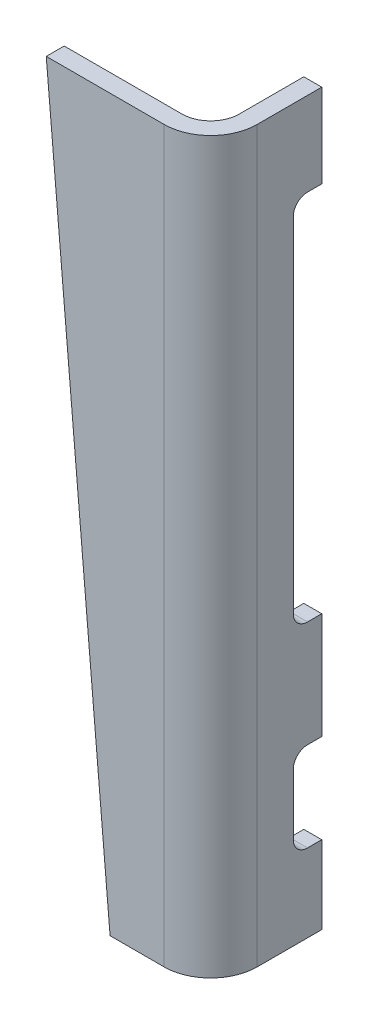
ISO-10303-21;
HEADER;
FILE_DESCRIPTION(('STEP AP214'),'2;1');
FILE_NAME('part.step','',(''),(''),'','','');
FILE_SCHEMA(('AUTOMOTIVE_DESIGN { 1 0 10303 214 1 1 1 1 }'));
ENDSEC;
DATA;
#1=APPLICATION_CONTEXT('core data for automotive mechanical design processes');
#2=APPLICATION_PROTOCOL_DEFINITION('international standard','automotive_design',2000,#1);
#3=PRODUCT_CONTEXT('',#1,'mechanical');
#4=PRODUCT('Part','Part','',(#3));
#5=PRODUCT_RELATED_PRODUCT_CATEGORY('part','',(#4));
#6=PRODUCT_DEFINITION_FORMATION('','',#4);
#7=PRODUCT_DEFINITION_CONTEXT('part definition',#1,'design');
#8=PRODUCT_DEFINITION('design','',#6,#7);
#9=PRODUCT_DEFINITION_SHAPE('','',#8);
#10=(LENGTH_UNIT() NAMED_UNIT(*) SI_UNIT(.MILLI.,.METRE.));
#11=(NAMED_UNIT(*) PLANE_ANGLE_UNIT() SI_UNIT($,.RADIAN.));
#12=(NAMED_UNIT(*) SI_UNIT($,.STERADIAN.) SOLID_ANGLE_UNIT());
#13=UNCERTAINTY_MEASURE_WITH_UNIT(LENGTH_MEASURE(1.E-05),#10,'distance_accuracy_value','');
#14=(GEOMETRIC_REPRESENTATION_CONTEXT(3) GLOBAL_UNCERTAINTY_ASSIGNED_CONTEXT((#13)) GLOBAL_UNIT_ASSIGNED_CONTEXT((#10,
#11,#12)) REPRESENTATION_CONTEXT('',''));
#15=CARTESIAN_POINT('',(0.,0.,0.));
#16=DIRECTION('',(0.,0.,1.));
#17=DIRECTION('',(1.,0.,0.));
#18=AXIS2_PLACEMENT_3D('',#15,#16,#17);
#19=CARTESIAN_POINT('',(-25.79021716039,-28.67914,-116.32184));
#20=DIRECTION('',(0.,-1.,0.));
#21=DIRECTION('',(0.,0.,-1.));
#22=AXIS2_PLACEMENT_3D('',#19,#20,#21);
#23=PLANE('',#22);
#24=DIRECTION('',(0.,0.,-1.));
#25=VECTOR('',#24,1.);
#26=CARTESIAN_POINT('',(-10.12616875329,-28.67914,-2.75336));
#27=LINE('',#26,#25);
#28=CARTESIAN_POINT('',(-10.12616875329,-28.67914,-116.32184));
#29=VERTEX_POINT('',#28);
#30=CARTESIAN_POINT('',(-10.12616875329,-28.67914,-113.94059));
#31=VERTEX_POINT('',#30);
#32=EDGE_CURVE('E247',#29,#31,#27,.F.);
#33=ORIENTED_EDGE('',*,*,#32,.T.);
#34=DIRECTION('',(1.,0.,0.));
#35=VECTOR('',#34,1.);
#36=CARTESIAN_POINT('',(-25.79021716039,-28.67914,-113.94059));
#37=LINE('',#36,#35);
#38=CARTESIAN_POINT('',(-7.126168753292,-28.67914,-113.94059));
#39=VERTEX_POINT('',#38);
#40=EDGE_CURVE('E110',#31,#39,#37,.T.);
#41=ORIENTED_EDGE('',*,*,#40,.T.);
#42=DIRECTION('',(0.,0.,-1.));
#43=VECTOR('',#42,1.);
#44=CARTESIAN_POINT('',(-7.126168753292,-28.67914,-2.75336));
#45=LINE('',#44,#43);
#46=CARTESIAN_POINT('',(-7.126168753292,-28.67914,-116.32184));
#47=VERTEX_POINT('',#46);
#48=EDGE_CURVE('E186',#47,#39,#45,.F.);
#49=ORIENTED_EDGE('',*,*,#48,.F.);
#50=DIRECTION('',(-1.,0.,0.));
#51=VECTOR('',#50,1.);
#52=CARTESIAN_POINT('',(-5.363668753293,-28.67914,-116.32184));
#53=LINE('',#52,#51);
#54=EDGE_CURVE('E120',#29,#47,#53,.F.);
#55=ORIENTED_EDGE('',*,*,#54,.F.);
#56=EDGE_LOOP('',(#33,#41,#49,#55));
#57=FACE_BOUND('',#56,.T.);
#58=ADVANCED_FACE('F17',(#57),#23,.F.);
#59=CARTESIAN_POINT('',(-25.79021716039,-26.29789,-113.94059));
#60=DIRECTION('',(1.,0.,0.));
#61=DIRECTION('',(0.,0.,-1.));
#62=AXIS2_PLACEMENT_3D('',#59,#60,#61);
#63=CYLINDRICAL_SURFACE('',#62,2.38125);
#64=CARTESIAN_POINT('',(-10.12616875329,-26.29789,-113.94059));
#65=DIRECTION('',(1.,0.,0.));
#66=DIRECTION('',(0.,0.,-1.));
#67=AXIS2_PLACEMENT_3D('',#64,#65,#66);
#68=CIRCLE('',#67,2.38125);
#69=CARTESIAN_POINT('',(-10.12616875329,-26.29789,-111.55934));
#70=VERTEX_POINT('',#69);
#71=EDGE_CURVE('E20',#31,#70,#68,.F.);
#72=ORIENTED_EDGE('',*,*,#71,.T.);
#73=DIRECTION('',(1.,0.,0.));
#74=VECTOR('',#73,1.);
#75=CARTESIAN_POINT('',(-25.79021716039,-26.29789,-111.55934));
#76=LINE('',#75,#74);
#77=CARTESIAN_POINT('',(-7.126168753292,-26.29789,-111.55934));
#78=VERTEX_POINT('',#77);
#79=EDGE_CURVE('E296',#70,#78,#76,.T.);
#80=ORIENTED_EDGE('',*,*,#79,.T.);
#81=CARTESIAN_POINT('',(-7.126168753292,-26.29789,-113.94059));
#82=DIRECTION('',(1.,0.,0.));
#83=DIRECTION('',(0.,0.,-1.));
#84=AXIS2_PLACEMENT_3D('',#81,#82,#83);
#85=CIRCLE('',#84,2.38125);
#86=EDGE_CURVE('E191',#39,#78,#85,.F.);
#87=ORIENTED_EDGE('',*,*,#86,.F.);
#88=ORIENTED_EDGE('',*,*,#40,.F.);
#89=EDGE_LOOP('',(#72,#80,#87,#88));
#90=FACE_BOUND('',#89,.T.);
#91=ADVANCED_FACE('F346',(#90),#63,.F.);
#92=CARTESIAN_POINT('',(-25.79021716039,-16.13789,-111.55934));
#93=DIRECTION('',(0.,0.,1.));
#94=DIRECTION('',(1.,0.,0.));
#95=AXIS2_PLACEMENT_3D('',#92,#93,#94);
#96=PLANE('',#95);
#97=DIRECTION('',(0.,1.,0.));
#98=VECTOR('',#97,1.);
#99=CARTESIAN_POINT('',(-10.12616875329,0.,-111.55934));
#100=LINE('',#99,#98);
#101=CARTESIAN_POINT('',(-10.12616875329,-16.13789,-111.55934));
#102=VERTEX_POINT('',#101);
#103=EDGE_CURVE('E244',#70,#102,#100,.T.);
#104=ORIENTED_EDGE('',*,*,#103,.T.);
#105=DIRECTION('',(1.,0.,0.));
#106=VECTOR('',#105,1.);
#107=CARTESIAN_POINT('',(-25.79021716039,-16.13789,-111.55934));
#108=LINE('',#107,#106);
#109=CARTESIAN_POINT('',(-7.126168753292,-16.13789,-111.55934));
#110=VERTEX_POINT('',#109);
#111=EDGE_CURVE('E293',#102,#110,#108,.T.);
#112=ORIENTED_EDGE('',*,*,#111,.T.);
#113=DIRECTION('',(0.,1.,0.));
#114=VECTOR('',#113,1.);
#115=CARTESIAN_POINT('',(-7.126168753292,0.,-111.55934));
#116=LINE('',#115,#114);
#117=EDGE_CURVE('E193',#78,#110,#116,.T.);
#118=ORIENTED_EDGE('',*,*,#117,.F.);
#119=ORIENTED_EDGE('',*,*,#79,.F.);
#120=EDGE_LOOP('',(#104,#112,#118,#119));
#121=FACE_BOUND('',#120,.T.);
#122=ADVANCED_FACE('F344',(#121),#96,.F.);
#123=CARTESIAN_POINT('',(-25.79021716039,-16.13789,-113.94059));
#124=DIRECTION('',(1.,0.,0.));
#125=DIRECTION('',(0.,0.,-1.));
#126=AXIS2_PLACEMENT_3D('',#123,#124,#125);
#127=CYLINDRICAL_SURFACE('',#126,2.38125);
#128=CARTESIAN_POINT('',(-10.12616875329,-16.13789,-113.94059));
#129=DIRECTION('',(1.,0.,0.));
#130=DIRECTION('',(0.,0.,-1.));
#131=AXIS2_PLACEMENT_3D('',#128,#129,#130);
#132=CIRCLE('',#131,2.38125);
#133=CARTESIAN_POINT('',(-10.12616875329,-13.75664,-113.94059));
#134=VERTEX_POINT('',#133);
#135=EDGE_CURVE('E241',#102,#134,#132,.F.);
#136=ORIENTED_EDGE('',*,*,#135,.T.);
#137=DIRECTION('',(1.,0.,0.));
#138=VECTOR('',#137,1.);
#139=CARTESIAN_POINT('',(-25.79021716039,-13.75664,-113.94059));
#140=LINE('',#139,#138);
#141=CARTESIAN_POINT('',(-7.126168753292,-13.75664,-113.94059));
#142=VERTEX_POINT('',#141);
#143=EDGE_CURVE('E288',#134,#142,#140,.T.);
#144=ORIENTED_EDGE('',*,*,#143,.T.);
#145=CARTESIAN_POINT('',(-7.126168753292,-16.13789,-113.94059));
#146=DIRECTION('',(1.,0.,0.));
#147=DIRECTION('',(0.,0.,-1.));
#148=AXIS2_PLACEMENT_3D('',#145,#146,#147);
#149=CIRCLE('',#148,2.38125);
#150=EDGE_CURVE('E326',#110,#142,#149,.F.);
#151=ORIENTED_EDGE('',*,*,#150,.F.);
#152=ORIENTED_EDGE('',*,*,#111,.F.);
#153=EDGE_LOOP('',(#136,#144,#151,#152));
#154=FACE_BOUND('',#153,.T.);
#155=ADVANCED_FACE('F334',(#154),#127,.F.);
#156=CARTESIAN_POINT('',(-25.79021716039,-13.75664,-116.32184));
#157=DIRECTION('',(0.,1.,0.));
#158=DIRECTION('',(0.,0.,1.));
#159=AXIS2_PLACEMENT_3D('',#156,#157,#158);
#160=PLANE('',#159);
#161=DIRECTION('',(0.,0.,-1.));
#162=VECTOR('',#161,1.);
#163=CARTESIAN_POINT('',(-10.12616875329,-13.75664,-2.75336));
#164=LINE('',#163,#162);
#165=CARTESIAN_POINT('',(-10.12616875329,-13.75664,-116.32184));
#166=VERTEX_POINT('',#165);
#167=EDGE_CURVE('E238',#134,#166,#164,.T.);
#168=ORIENTED_EDGE('',*,*,#167,.T.);
#169=DIRECTION('',(-1.,0.,0.));
#170=VECTOR('',#169,1.);
#171=CARTESIAN_POINT('',(-5.363668753293,-13.75664,-116.32184));
#172=LINE('',#171,#170);
#173=CARTESIAN_POINT('',(-7.126168753292,-13.75664,-116.32184));
#174=VERTEX_POINT('',#173);
#175=EDGE_CURVE('E278',#174,#166,#172,.T.);
#176=ORIENTED_EDGE('',*,*,#175,.F.);
#177=DIRECTION('',(0.,0.,-1.));
#178=VECTOR('',#177,1.);
#179=CARTESIAN_POINT('',(-7.126168753292,-13.75664,-2.75336));
#180=LINE('',#179,#178);
#181=EDGE_CURVE('E284',#142,#174,#180,.T.);
#182=ORIENTED_EDGE('',*,*,#181,.F.);
#183=ORIENTED_EDGE('',*,*,#143,.F.);
#184=EDGE_LOOP('',(#168,#176,#182,#183));
#185=FACE_BOUND('',#184,.T.);
#186=ADVANCED_FACE('F380',(#185),#160,.F.);
#187=CARTESIAN_POINT('',(-5.363668753293,80.22336,-116.32184));
#188=DIRECTION('',(0.,0.,-1.));
#189=DIRECTION('',(-1.,0.,0.));
#190=AXIS2_PLACEMENT_3D('',#187,#188,#189);
#191=PLANE('',#190);
#192=DIRECTION('',(0.,1.,0.));
#193=VECTOR('',#192,1.);
#194=CARTESIAN_POINT('',(-7.126168753292,0.,-116.32184));
#195=LINE('',#194,#193);
#196=CARTESIAN_POINT('',(-7.126168753292,4.02336,-116.32184));
#197=VERTEX_POINT('',#196);
#198=EDGE_CURVE('E281',#174,#197,#195,.T.);
#199=ORIENTED_EDGE('',*,*,#198,.F.);
#200=ORIENTED_EDGE('',*,*,#175,.T.);
#201=DIRECTION('',(0.,1.,0.));
#202=VECTOR('',#201,1.);
#203=CARTESIAN_POINT('',(-10.12616875329,0.,-116.32184));
#204=LINE('',#203,#202);
#205=CARTESIAN_POINT('',(-10.12616875329,4.02336,-116.32184));
#206=VERTEX_POINT('',#205);
#207=EDGE_CURVE('E235',#166,#206,#204,.T.);
#208=ORIENTED_EDGE('',*,*,#207,.T.);
#209=DIRECTION('',(1.,0.,0.));
#210=VECTOR('',#209,1.);
#211=CARTESIAN_POINT('',(72.09491389266,4.02336,-116.32184));
#212=LINE('',#211,#210);
#213=EDGE_CURVE('E275',#206,#197,#212,.T.);
#214=ORIENTED_EDGE('',*,*,#213,.T.);
#215=EDGE_LOOP('',(#199,#200,#208,#214));
#216=FACE_BOUND('',#215,.T.);
#217=ADVANCED_FACE('F382',(#216),#191,.T.);
#218=CARTESIAN_POINT('',(72.09491389266,4.02336,-113.94059));
#219=DIRECTION('',(0.,-1.,0.));
#220=DIRECTION('',(0.,0.,-1.));
#221=AXIS2_PLACEMENT_3D('',#218,#219,#220);
#222=PLANE('',#221);
#223=DIRECTION('',(0.,0.,-1.));
#224=VECTOR('',#223,1.);
#225=CARTESIAN_POINT('',(-10.12616875329,4.02336,-2.75336));
#226=LINE('',#225,#224);
#227=CARTESIAN_POINT('',(-10.12616875329,4.02336,-113.94059));
#228=VERTEX_POINT('',#227);
#229=EDGE_CURVE('E232',#206,#228,#226,.F.);
#230=ORIENTED_EDGE('',*,*,#229,.T.);
#231=DIRECTION('',(-1.,0.,0.));
#232=VECTOR('',#231,1.);
#233=CARTESIAN_POINT('',(72.09491389266,4.02336,-113.94059));
#234=LINE('',#233,#232);
#235=CARTESIAN_POINT('',(-7.126168753292,4.02336,-113.94059));
#236=VERTEX_POINT('',#235);
#237=EDGE_CURVE('E272',#228,#236,#234,.F.);
#238=ORIENTED_EDGE('',*,*,#237,.T.);
#239=DIRECTION('',(0.,0.,-1.));
#240=VECTOR('',#239,1.);
#241=CARTESIAN_POINT('',(-7.126168753292,4.02336,-2.75336));
#242=LINE('',#241,#240);
#243=EDGE_CURVE('E283',#197,#236,#242,.F.);
#244=ORIENTED_EDGE('',*,*,#243,.F.);
#245=ORIENTED_EDGE('',*,*,#213,.F.);
#246=EDGE_LOOP('',(#230,#238,#244,#245));
#247=FACE_BOUND('',#246,.T.);
#248=ADVANCED_FACE('F386',(#247),#222,.F.);
#249=CARTESIAN_POINT('',(72.09491389266,6.40461,-113.94059));
#250=DIRECTION('',(-1.,0.,0.));
#251=DIRECTION('',(0.,0.,1.));
#252=AXIS2_PLACEMENT_3D('',#249,#250,#251);
#253=CYLINDRICAL_SURFACE('',#252,2.38125);
#254=CARTESIAN_POINT('',(-10.12616875329,6.40461,-113.94059));
#255=DIRECTION('',(-1.,0.,0.));
#256=DIRECTION('',(0.,0.,1.));
#257=AXIS2_PLACEMENT_3D('',#254,#255,#256);
#258=CIRCLE('',#257,2.38125);
#259=CARTESIAN_POINT('',(-10.12616875329,6.40461,-111.55934));
#260=VERTEX_POINT('',#259);
#261=EDGE_CURVE('E231',#228,#260,#258,.T.);
#262=ORIENTED_EDGE('',*,*,#261,.T.);
#263=DIRECTION('',(1.,0.,0.));
#264=VECTOR('',#263,1.);
#265=CARTESIAN_POINT('',(72.09491389266,6.40461,-111.55934));
#266=LINE('',#265,#264);
#267=CARTESIAN_POINT('',(-7.126168753292,6.40461,-111.55934));
#268=VERTEX_POINT('',#267);
#269=EDGE_CURVE('E269',#260,#268,#266,.T.);
#270=ORIENTED_EDGE('',*,*,#269,.T.);
#271=CARTESIAN_POINT('',(-7.126168753292,6.40461,-113.94059));
#272=DIRECTION('',(-1.,0.,0.));
#273=DIRECTION('',(0.,0.,1.));
#274=AXIS2_PLACEMENT_3D('',#271,#272,#273);
#275=CIRCLE('',#274,2.38125);
#276=EDGE_CURVE('E324',#236,#268,#275,.T.);
#277=ORIENTED_EDGE('',*,*,#276,.F.);
#278=ORIENTED_EDGE('',*,*,#237,.F.);
#279=EDGE_LOOP('',(#262,#270,#277,#278));
#280=FACE_BOUND('',#279,.T.);
#281=ADVANCED_FACE('F390',(#280),#253,.F.);
#282=CARTESIAN_POINT('',(72.09491389266,65.14211,-111.55934));
#283=DIRECTION('',(0.,0.,1.));
#284=DIRECTION('',(1.,0.,0.));
#285=AXIS2_PLACEMENT_3D('',#282,#283,#284);
#286=PLANE('',#285);
#287=DIRECTION('',(0.,1.,0.));
#288=VECTOR('',#287,1.);
#289=CARTESIAN_POINT('',(-7.126168753292,0.,-111.55934));
#290=LINE('',#289,#288);
#291=CARTESIAN_POINT('',(-7.1261687532925,63.84236,-111.55934));
#292=VERTEX_POINT('',#291);
#293=EDGE_CURVE('E323',#268,#292,#290,.T.);
#294=ORIENTED_EDGE('',*,*,#293,.F.);
#295=ORIENTED_EDGE('',*,*,#269,.F.);
#296=DIRECTION('',(0.,1.,0.));
#297=VECTOR('',#296,1.);
#298=CARTESIAN_POINT('',(-10.12616875329,0.,-111.55934));
#299=LINE('',#298,#297);
#300=CARTESIAN_POINT('',(-10.12616875329,63.84236,-111.55934));
#301=VERTEX_POINT('',#300);
#302=EDGE_CURVE('E228',#260,#301,#299,.T.);
#303=ORIENTED_EDGE('',*,*,#302,.T.);
#304=DIRECTION('',(-1.,0.,0.));
#305=VECTOR('',#304,1.);
#306=CARTESIAN_POINT('',(40.07981211837,63.84236,-111.55934));
#307=LINE('',#306,#305);
#308=EDGE_CURVE('E266',#301,#292,#307,.F.);
#309=ORIENTED_EDGE('',*,*,#308,.T.);
#310=EDGE_LOOP('',(#294,#295,#303,#309));
#311=FACE_BOUND('',#310,.T.);
#312=ADVANCED_FACE('F394',(#311),#286,.F.);
#313=CARTESIAN_POINT('',(40.07981211837,63.84236,-113.94034));
#314=DIRECTION('',(-1.,0.,0.));
#315=DIRECTION('',(0.,0.,1.));
#316=AXIS2_PLACEMENT_3D('',#313,#314,#315);
#317=CYLINDRICAL_SURFACE('',#316,2.381);
#318=CARTESIAN_POINT('',(-10.12616875329,63.84236,-113.94034));
#319=DIRECTION('',(-1.,0.,0.));
#320=DIRECTION('',(0.,0.,1.));
#321=AXIS2_PLACEMENT_3D('',#318,#319,#320);
#322=CIRCLE('',#321,2.381);
#323=CARTESIAN_POINT('',(-10.12616875329,66.22336,-113.94034));
#324=VERTEX_POINT('',#323);
#325=EDGE_CURVE('E225',#301,#324,#322,.T.);
#326=ORIENTED_EDGE('',*,*,#325,.T.);
#327=DIRECTION('',(1.,0.,0.));
#328=VECTOR('',#327,1.);
#329=CARTESIAN_POINT('',(40.07981211837,66.22336,-113.94034));
#330=LINE('',#329,#328);
#331=CARTESIAN_POINT('',(-7.1261687532925,66.22336,-113.94034));
#332=VERTEX_POINT('',#331);
#333=EDGE_CURVE('E182',#324,#332,#330,.T.);
#334=ORIENTED_EDGE('',*,*,#333,.T.);
#335=CARTESIAN_POINT('',(-7.126168753293,63.84236,-113.94034));
#336=DIRECTION('',(-1.,0.,0.));
#337=DIRECTION('',(0.,0.,1.));
#338=AXIS2_PLACEMENT_3D('',#335,#336,#337);
#339=CIRCLE('',#338,2.381);
#340=EDGE_CURVE('E321',#292,#332,#339,.T.);
#341=ORIENTED_EDGE('',*,*,#340,.F.);
#342=ORIENTED_EDGE('',*,*,#308,.F.);
#343=EDGE_LOOP('',(#326,#334,#341,#342));
#344=FACE_BOUND('',#343,.T.);
#345=ADVANCED_FACE('F397',(#344),#317,.F.);
#346=CARTESIAN_POINT('',(40.07981211837,66.22336,-116.32184));
#347=DIRECTION('',(0.,1.,0.));
#348=DIRECTION('',(0.,0.,1.));
#349=AXIS2_PLACEMENT_3D('',#346,#347,#348);
#350=PLANE('',#349);
#351=DIRECTION('',(0.,0.,-1.));
#352=VECTOR('',#351,1.);
#353=CARTESIAN_POINT('',(-10.12616875329,66.22336,-2.75336));
#354=LINE('',#353,#352);
#355=CARTESIAN_POINT('',(-10.12616875329,66.22336,-116.32184));
#356=VERTEX_POINT('',#355);
#357=EDGE_CURVE('E213',#324,#356,#354,.T.);
#358=ORIENTED_EDGE('',*,*,#357,.T.);
#359=DIRECTION('',(-1.,0.,0.));
#360=VECTOR('',#359,1.);
#361=CARTESIAN_POINT('',(-5.363668753293,66.22336,-116.32184));
#362=LINE('',#361,#360);
#363=CARTESIAN_POINT('',(-7.12616875329233,66.22336,-116.32184));
#364=VERTEX_POINT('',#363);
#365=EDGE_CURVE('E171',#364,#356,#362,.T.);
#366=ORIENTED_EDGE('',*,*,#365,.F.);
#367=DIRECTION('',(0.,0.,-1.));
#368=VECTOR('',#367,1.);
#369=CARTESIAN_POINT('',(-7.126168753292,66.22336,-2.75336));
#370=LINE('',#369,#368);
#371=EDGE_CURVE('E218',#332,#364,#370,.T.);
#372=ORIENTED_EDGE('',*,*,#371,.F.);
#373=ORIENTED_EDGE('',*,*,#333,.F.);
#374=EDGE_LOOP('',(#358,#366,#372,#373));
#375=FACE_BOUND('',#374,.T.);
#376=ADVANCED_FACE('F436',(#375),#350,.F.);
#377=CARTESIAN_POINT('',(-5.363668753293,80.22336,-116.32184));
#378=DIRECTION('',(0.,0.,-1.));
#379=DIRECTION('',(-1.,0.,0.));
#380=AXIS2_PLACEMENT_3D('',#377,#378,#379);
#381=PLANE('',#380);
#382=DIRECTION('',(0.,1.,0.));
#383=VECTOR('',#382,1.);
#384=CARTESIAN_POINT('',(-10.12616875329,0.,-116.32184));
#385=LINE('',#384,#383);
#386=CARTESIAN_POINT('',(-10.12616875329,-41.69664,-116.32184));
#387=VERTEX_POINT('',#386);
#388=EDGE_CURVE('E181',#387,#29,#385,.T.);
#389=ORIENTED_EDGE('',*,*,#388,.T.);
#390=ORIENTED_EDGE('',*,*,#54,.T.);
#391=DIRECTION('',(0.,1.,0.));
#392=VECTOR('',#391,1.);
#393=CARTESIAN_POINT('',(-7.126168753292,0.,-116.32184));
#394=LINE('',#393,#392);
#395=CARTESIAN_POINT('',(-7.126168753292,-41.69664,-116.32184));
#396=VERTEX_POINT('',#395);
#397=EDGE_CURVE('E179',#396,#47,#394,.T.);
#398=ORIENTED_EDGE('',*,*,#397,.F.);
#399=DIRECTION('',(1.,0.,0.));
#400=VECTOR('',#399,1.);
#401=CARTESIAN_POINT('',(-5.363668753292,-41.69664,-116.32184));
#402=LINE('',#401,#400);
#403=EDGE_CURVE('E217',#387,#396,#402,.T.);
#404=ORIENTED_EDGE('',*,*,#403,.F.);
#405=EDGE_LOOP('',(#389,#390,#398,#404));
#406=FACE_BOUND('',#405,.T.);
#407=ADVANCED_FACE('F177',(#406),#381,.T.);
#408=CARTESIAN_POINT('',(-5.363668753293,80.22336,-116.32184));
#409=DIRECTION('',(0.,0.,-1.));
#410=DIRECTION('',(-1.,0.,0.));
#411=AXIS2_PLACEMENT_3D('',#408,#409,#410);
#412=PLANE('',#411);
#413=DIRECTION('',(0.,1.,0.));
#414=VECTOR('',#413,1.);
#415=CARTESIAN_POINT('',(-7.126168753292,0.,-116.32184));
#416=LINE('',#415,#414);
#417=CARTESIAN_POINT('',(-7.12616875329267,80.2233600000003,-116.32184));
#418=VERTEX_POINT('',#417);
#419=EDGE_CURVE('E201',#364,#418,#416,.T.);
#420=ORIENTED_EDGE('',*,*,#419,.F.);
#421=ORIENTED_EDGE('',*,*,#365,.T.);
#422=DIRECTION('',(0.,1.,0.));
#423=VECTOR('',#422,1.);
#424=CARTESIAN_POINT('',(-10.12616875329,0.,-116.32184));
#425=LINE('',#424,#423);
#426=CARTESIAN_POINT('',(-10.12616875329,80.2233600000003,-116.32184));
#427=VERTEX_POINT('',#426);
#428=EDGE_CURVE('E251',#356,#427,#425,.T.);
#429=ORIENTED_EDGE('',*,*,#428,.T.);
#430=DIRECTION('',(1.,0.,0.));
#431=VECTOR('',#430,1.);
#432=CARTESIAN_POINT('',(-5.363668753293,80.2233600000003,-116.32184));
#433=LINE('',#432,#431);
#434=EDGE_CURVE('E206',#418,#427,#433,.F.);
#435=ORIENTED_EDGE('',*,*,#434,.F.);
#436=EDGE_LOOP('',(#420,#421,#429,#435));
#437=FACE_BOUND('',#436,.T.);
#438=ADVANCED_FACE('F402',(#437),#412,.T.);
#439=CARTESIAN_POINT('',(-10.12616875329,0.,-2.75336));
#440=DIRECTION('',(1.,0.,0.));
#441=DIRECTION('',(0.,0.,-1.));
#442=AXIS2_PLACEMENT_3D('',#439,#440,#441);
#443=PLANE('',#442);
#444=ORIENTED_EDGE('',*,*,#325,.F.);
#445=ORIENTED_EDGE('',*,*,#302,.F.);
#446=ORIENTED_EDGE('',*,*,#261,.F.);
#447=ORIENTED_EDGE('',*,*,#229,.F.);
#448=ORIENTED_EDGE('',*,*,#207,.F.);
#449=ORIENTED_EDGE('',*,*,#167,.F.);
#450=ORIENTED_EDGE('',*,*,#135,.F.);
#451=ORIENTED_EDGE('',*,*,#103,.F.);
#452=ORIENTED_EDGE('',*,*,#71,.F.);
#453=ORIENTED_EDGE('',*,*,#32,.F.);
#454=ORIENTED_EDGE('',*,*,#388,.F.);
#455=DIRECTION('',(0.,0.,-1.));
#456=VECTOR('',#455,1.);
#457=CARTESIAN_POINT('',(-10.12616875329,-41.69664,-116.32184));
#458=LINE('',#457,#456);
#459=CARTESIAN_POINT('',(-10.12616875329,-41.69664,-105.53192));
#460=VERTEX_POINT('',#459);
#461=EDGE_CURVE('E316',#460,#387,#458,.T.);
#462=ORIENTED_EDGE('',*,*,#461,.F.);
#463=DIRECTION('',(0.,1.,0.));
#464=VECTOR('',#463,1.);
#465=CARTESIAN_POINT('',(-10.12616875329,80.22336,-105.53192));
#466=LINE('',#465,#464);
#467=CARTESIAN_POINT('',(-10.12616875329,80.22336,-105.53192));
#468=VERTEX_POINT('',#467);
#469=EDGE_CURVE('E209',#460,#468,#466,.T.);
#470=ORIENTED_EDGE('',*,*,#469,.T.);
#471=DIRECTION('',(0.,0.,1.));
#472=VECTOR('',#471,1.);
#473=CARTESIAN_POINT('',(-10.12616875329,80.22336,-100.75672));
#474=LINE('',#473,#472);
#475=EDGE_CURVE('E208',#427,#468,#474,.T.);
#476=ORIENTED_EDGE('',*,*,#475,.F.);
#477=ORIENTED_EDGE('',*,*,#428,.F.);
#478=ORIENTED_EDGE('',*,*,#357,.F.);
#479=EDGE_LOOP('',(#444,#445,#446,#447,#448,#449,#450,#451,#452,#453,#454,#462,#470,#476,#477,#478));
#480=FACE_BOUND('',#479,.T.);
#481=ADVANCED_FACE('F341',(#480),#443,.F.);
#482=CARTESIAN_POINT('',(22.61016249341,1.97644617377E-13,-97.75672));
#483=DIRECTION('',(0.,0.,1.));
#484=DIRECTION('',(1.,0.,0.));
#485=AXIS2_PLACEMENT_3D('',#482,#483,#484);
#486=PLANE('',#485);
#487=DIRECTION('',(0.,1.,0.));
#488=VECTOR('',#487,1.);
#489=CARTESIAN_POINT('',(-14.90136875329,80.22336,-97.75672));
#490=LINE('',#489,#488);
#491=CARTESIAN_POINT('',(-14.90136875329,80.22336,-97.75672));
#492=VERTEX_POINT('',#491);
#493=CARTESIAN_POINT('',(-14.90136875329,-41.69664,-97.75672));
#494=VERTEX_POINT('',#493);
#495=EDGE_CURVE('E203',#492,#494,#490,.F.);
#496=ORIENTED_EDGE('',*,*,#495,.F.);
#497=DIRECTION('',(1.,0.,0.));
#498=VECTOR('',#497,1.);
#499=CARTESIAN_POINT('',(-5.363668753293,80.22336,-97.75672));
#500=LINE('',#499,#498);
#501=CARTESIAN_POINT('',(-34.5980037380773,80.2233600000002,-97.75672));
#502=VERTEX_POINT('',#501);
#503=EDGE_CURVE('E311',#502,#492,#500,.T.);
#504=ORIENTED_EDGE('',*,*,#503,.F.);
#505=DIRECTION('',(-0.0871557427476639,0.996194698091745,0.));
#506=VECTOR('',#505,1.);
#507=CARTESIAN_POINT('',(-34.20233373199,75.70083113585,-97.75672));
#508=LINE('',#507,#506);
#509=CARTESIAN_POINT('',(-23.9313858809969,-41.6966399999997,-97.75672));
#510=VERTEX_POINT('',#509);
#511=EDGE_CURVE('E214',#502,#510,#508,.F.);
#512=ORIENTED_EDGE('',*,*,#511,.T.);
#513=DIRECTION('',(1.,0.,0.));
#514=VECTOR('',#513,1.);
#515=CARTESIAN_POINT('',(-5.363668753292,-41.69664,-97.75672));
#516=LINE('',#515,#514);
#517=EDGE_CURVE('E320',#494,#510,#516,.F.);
#518=ORIENTED_EDGE('',*,*,#517,.F.);
#519=EDGE_LOOP('',(#496,#504,#512,#518));
#520=FACE_BOUND('',#519,.T.);
#521=ADVANCED_FACE('F464',(#520),#486,.T.);
#522=CARTESIAN_POINT('',(-14.90136875329,80.22336,-105.53192));
#523=DIRECTION('',(0.,1.,0.));
#524=DIRECTION('',(0.,0.,1.));
#525=AXIS2_PLACEMENT_3D('',#522,#523,#524);
#526=CYLINDRICAL_SURFACE('',#525,7.7752);
#527=CARTESIAN_POINT('',(-14.90136875329,80.22336,-105.53192));
#528=DIRECTION('',(0.,1.,0.));
#529=DIRECTION('',(0.,0.,1.));
#530=AXIS2_PLACEMENT_3D('',#527,#528,#529);
#531=CIRCLE('',#530,7.7752);
#532=CARTESIAN_POINT('',(-7.1261687532925,80.22336,-105.53192));
#533=VERTEX_POINT('',#532);
#534=EDGE_CURVE('E143',#492,#533,#531,.T.);
#535=ORIENTED_EDGE('',*,*,#534,.F.);
#536=ORIENTED_EDGE('',*,*,#495,.T.);
#537=CARTESIAN_POINT('',(-14.90136875329,-41.69664,-105.53192));
#538=DIRECTION('',(0.,1.,0.));
#539=DIRECTION('',(0.,0.,1.));
#540=AXIS2_PLACEMENT_3D('',#537,#538,#539);
#541=CIRCLE('',#540,7.7752);
#542=CARTESIAN_POINT('',(-7.126168753292,-41.69664,-105.53192));
#543=VERTEX_POINT('',#542);
#544=EDGE_CURVE('E317',#543,#494,#541,.F.);
#545=ORIENTED_EDGE('',*,*,#544,.F.);
#546=DIRECTION('',(0.,1.,0.));
#547=VECTOR('',#546,1.);
#548=CARTESIAN_POINT('',(-7.126168753292,0.,-105.53192));
#549=LINE('',#548,#547);
#550=EDGE_CURVE('E189',#533,#543,#549,.F.);
#551=ORIENTED_EDGE('',*,*,#550,.F.);
#552=EDGE_LOOP('',(#535,#536,#545,#551));
#553=FACE_BOUND('',#552,.T.);
#554=ADVANCED_FACE('F461',(#553),#526,.T.);
#555=CARTESIAN_POINT('',(-7.126168753292,0.,-2.75336));
#556=DIRECTION('',(1.,0.,0.));
#557=DIRECTION('',(0.,0.,-1.));
#558=AXIS2_PLACEMENT_3D('',#555,#556,#557);
#559=PLANE('',#558);
#560=ORIENTED_EDGE('',*,*,#340,.T.);
#561=ORIENTED_EDGE('',*,*,#371,.T.);
#562=ORIENTED_EDGE('',*,*,#419,.T.);
#563=DIRECTION('',(0.,0.,1.));
#564=VECTOR('',#563,1.);
#565=CARTESIAN_POINT('',(-7.126168753293,80.22336,-100.75672));
#566=LINE('',#565,#564);
#567=EDGE_CURVE('E310',#533,#418,#566,.F.);
#568=ORIENTED_EDGE('',*,*,#567,.F.);
#569=ORIENTED_EDGE('',*,*,#550,.T.);
#570=DIRECTION('',(0.,0.,-1.));
#571=VECTOR('',#570,1.);
#572=CARTESIAN_POINT('',(-7.126168753292,-41.69664,-116.32184));
#573=LINE('',#572,#571);
#574=EDGE_CURVE('E188',#396,#543,#573,.F.);
#575=ORIENTED_EDGE('',*,*,#574,.F.);
#576=ORIENTED_EDGE('',*,*,#397,.T.);
#577=ORIENTED_EDGE('',*,*,#48,.T.);
#578=ORIENTED_EDGE('',*,*,#86,.T.);
#579=ORIENTED_EDGE('',*,*,#117,.T.);
#580=ORIENTED_EDGE('',*,*,#150,.T.);
#581=ORIENTED_EDGE('',*,*,#181,.T.);
#582=ORIENTED_EDGE('',*,*,#198,.T.);
#583=ORIENTED_EDGE('',*,*,#243,.T.);
#584=ORIENTED_EDGE('',*,*,#276,.T.);
#585=ORIENTED_EDGE('',*,*,#293,.T.);
#586=EDGE_LOOP('',(#560,#561,#562,#568,#569,#575,#576,#577,#578,#579,#580,#581,#582,#583,#584,#585));
#587=FACE_BOUND('',#586,.T.);
#588=ADVANCED_FACE('F185',(#587),#559,.T.);
#589=CARTESIAN_POINT('',(-34.20233373199,75.70083113585,-100.75672));
#590=DIRECTION('',(0.996194698091745,0.0871557427476639,0.));
#591=DIRECTION('',(-0.0871557427476639,0.996194698091745,0.));
#592=AXIS2_PLACEMENT_3D('',#589,#590,#591);
#593=PLANE('',#592);
#594=DIRECTION('',(0.0871557427476529,-0.996194698091746,0.));
#595=VECTOR('',#594,1.);
#596=CARTESIAN_POINT('',(-34.59800373808,80.22336,-100.75672));
#597=LINE('',#596,#595);
#598=CARTESIAN_POINT('',(-34.59800373808,80.22336,-100.75672));
#599=VERTEX_POINT('',#598);
#600=CARTESIAN_POINT('',(-23.931385881,-41.69664,-100.75672));
#601=VERTEX_POINT('',#600);
#602=EDGE_CURVE('E150',#599,#601,#597,.T.);
#603=ORIENTED_EDGE('',*,*,#602,.T.);
#604=DIRECTION('',(0.,0.,-1.));
#605=VECTOR('',#604,1.);
#606=CARTESIAN_POINT('',(-23.931385881,-41.69664,-116.32184));
#607=LINE('',#606,#605);
#608=EDGE_CURVE('E352',#510,#601,#607,.T.);
#609=ORIENTED_EDGE('',*,*,#608,.F.);
#610=ORIENTED_EDGE('',*,*,#511,.F.);
#611=DIRECTION('',(0.,0.,1.));
#612=VECTOR('',#611,1.);
#613=CARTESIAN_POINT('',(-34.59800373808,80.22336,-100.75672));
#614=LINE('',#613,#612);
#615=EDGE_CURVE('E313',#599,#502,#614,.T.);
#616=ORIENTED_EDGE('',*,*,#615,.F.);
#617=EDGE_LOOP('',(#603,#609,#610,#616));
#618=FACE_BOUND('',#617,.T.);
#619=ADVANCED_FACE('F431',(#618),#593,.F.);
#620=CARTESIAN_POINT('',(-5.363668753292,-41.69664,-116.32184));
#621=DIRECTION('',(0.,-1.,0.));
#622=DIRECTION('',(0.,0.,-1.));
#623=AXIS2_PLACEMENT_3D('',#620,#621,#622);
#624=PLANE('',#623);
#625=CARTESIAN_POINT('',(-14.90136875329,-41.69664,-105.53192));
#626=DIRECTION('',(0.,1.,0.));
#627=DIRECTION('',(0.,0.,1.));
#628=AXIS2_PLACEMENT_3D('',#625,#626,#627);
#629=CIRCLE('',#628,4.7752);
#630=CARTESIAN_POINT('',(-14.90136875329,-41.69664,-100.75672));
#631=VERTEX_POINT('',#630);
#632=EDGE_CURVE('E223',#631,#460,#629,.T.);
#633=ORIENTED_EDGE('',*,*,#632,.T.);
#634=ORIENTED_EDGE('',*,*,#461,.T.);
#635=ORIENTED_EDGE('',*,*,#403,.T.);
#636=ORIENTED_EDGE('',*,*,#574,.T.);
#637=ORIENTED_EDGE('',*,*,#544,.T.);
#638=ORIENTED_EDGE('',*,*,#517,.T.);
#639=ORIENTED_EDGE('',*,*,#608,.T.);
#640=DIRECTION('',(1.,0.,0.));
#641=VECTOR('',#640,1.);
#642=CARTESIAN_POINT('',(22.61016249341,-41.69664,-100.75672));
#643=LINE('',#642,#641);
#644=EDGE_CURVE('E407',#601,#631,#643,.T.);
#645=ORIENTED_EDGE('',*,*,#644,.T.);
#646=EDGE_LOOP('',(#633,#634,#635,#636,#637,#638,#639,#645));
#647=FACE_BOUND('',#646,.T.);
#648=ADVANCED_FACE('F350',(#647),#624,.T.);
#649=CARTESIAN_POINT('',(-14.90136875329,80.22336,-105.53192));
#650=DIRECTION('',(0.,1.,0.));
#651=DIRECTION('',(0.,0.,1.));
#652=AXIS2_PLACEMENT_3D('',#649,#650,#651);
#653=CYLINDRICAL_SURFACE('',#652,4.7752);
#654=ORIENTED_EDGE('',*,*,#469,.F.);
#655=ORIENTED_EDGE('',*,*,#632,.F.);
#656=DIRECTION('',(0.,1.,0.));
#657=VECTOR('',#656,1.);
#658=CARTESIAN_POINT('',(-14.90136875329,2.035054832982E-13,-100.75672));
#659=LINE('',#658,#657);
#660=CARTESIAN_POINT('',(-14.90136875329,80.22336,-100.75672));
#661=VERTEX_POINT('',#660);
#662=EDGE_CURVE('E26',#631,#661,#659,.T.);
#663=ORIENTED_EDGE('',*,*,#662,.T.);
#664=CARTESIAN_POINT('',(-14.90136875329,80.22336,-105.53192));
#665=DIRECTION('',(0.,1.,0.));
#666=DIRECTION('',(0.,0.,1.));
#667=AXIS2_PLACEMENT_3D('',#664,#665,#666);
#668=CIRCLE('',#667,4.7752);
#669=EDGE_CURVE('E34',#468,#661,#668,.F.);
#670=ORIENTED_EDGE('',*,*,#669,.F.);
#671=EDGE_LOOP('',(#654,#655,#663,#670));
#672=FACE_BOUND('',#671,.T.);
#673=ADVANCED_FACE('F434',(#672),#653,.F.);
#674=CARTESIAN_POINT('',(-5.363668753293,80.22336,-100.75672));
#675=DIRECTION('',(0.,1.,0.));
#676=DIRECTION('',(0.,0.,1.));
#677=AXIS2_PLACEMENT_3D('',#674,#675,#676);
#678=PLANE('',#677);
#679=ORIENTED_EDGE('',*,*,#534,.T.);
#680=ORIENTED_EDGE('',*,*,#567,.T.);
#681=ORIENTED_EDGE('',*,*,#434,.T.);
#682=ORIENTED_EDGE('',*,*,#475,.T.);
#683=ORIENTED_EDGE('',*,*,#669,.T.);
#684=DIRECTION('',(1.,0.,0.));
#685=VECTOR('',#684,1.);
#686=CARTESIAN_POINT('',(22.61016249341,80.22336,-100.75672));
#687=LINE('',#686,#685);
#688=EDGE_CURVE('E11',#661,#599,#687,.F.);
#689=ORIENTED_EDGE('',*,*,#688,.T.);
#690=ORIENTED_EDGE('',*,*,#615,.T.);
#691=ORIENTED_EDGE('',*,*,#503,.T.);
#692=EDGE_LOOP('',(#679,#680,#681,#682,#683,#689,#690,#691));
#693=FACE_BOUND('',#692,.T.);
#694=ADVANCED_FACE('F405',(#693),#678,.T.);
#695=CARTESIAN_POINT('',(22.61016249341,2.035054832982E-13,-100.75672));
#696=DIRECTION('',(0.,0.,1.));
#697=DIRECTION('',(1.,0.,0.));
#698=AXIS2_PLACEMENT_3D('',#695,#696,#697);
#699=PLANE('',#698);
#700=ORIENTED_EDGE('',*,*,#662,.F.);
#701=ORIENTED_EDGE('',*,*,#644,.F.);
#702=ORIENTED_EDGE('',*,*,#602,.F.);
#703=ORIENTED_EDGE('',*,*,#688,.F.);
#704=EDGE_LOOP('',(#700,#701,#702,#703));
#705=FACE_BOUND('',#704,.T.);
#706=ADVANCED_FACE('F429',(#705),#699,.F.);
#707=CLOSED_SHELL('',(#58,#91,#122,#155,#186,#217,#248,#281,#312,#345,#376,#407,#438,#481,#521,
#554,#588,#619,#648,#673,#694,#706));
#708=MANIFOLD_SOLID_BREP('B1',#707);
#709=ADVANCED_BREP_SHAPE_REPRESENTATION('',(#18,#708),#14);
#710=SHAPE_DEFINITION_REPRESENTATION(#9,#709);
ENDSEC;
END-ISO-10303-21;
